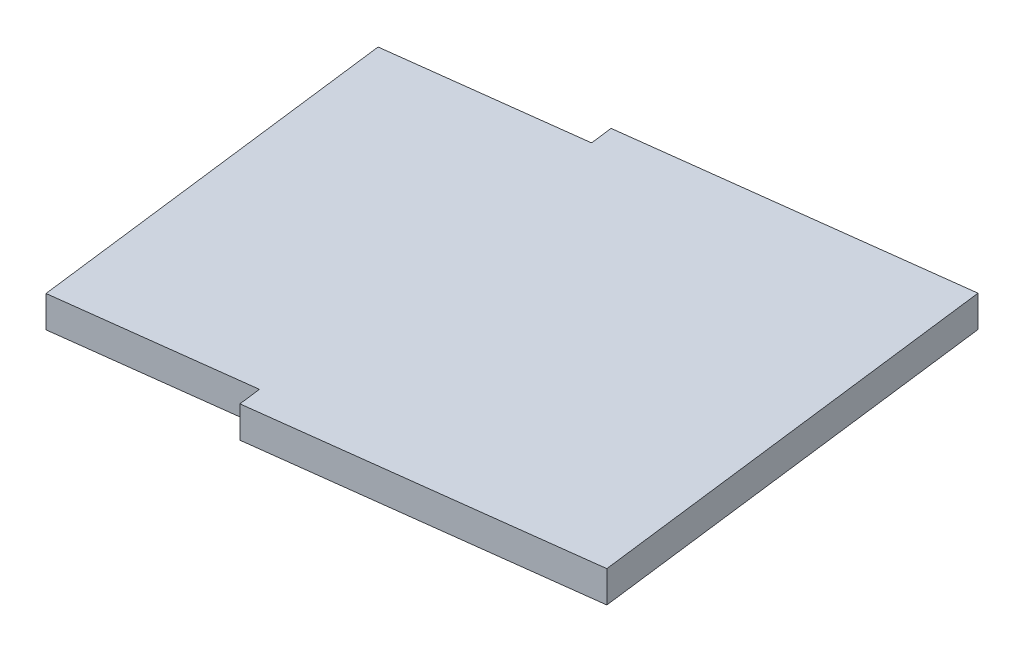
ISO-10303-21;
HEADER;
FILE_DESCRIPTION(('STEP AP214'),'2;1');
FILE_NAME('part.step','',(''),(''),'','','');
FILE_SCHEMA(('AUTOMOTIVE_DESIGN { 1 0 10303 214 1 1 1 1 }'));
ENDSEC;
DATA;
#1=APPLICATION_CONTEXT('core data for automotive mechanical design processes');
#2=APPLICATION_PROTOCOL_DEFINITION('international standard','automotive_design',2000,#1);
#3=PRODUCT_CONTEXT('',#1,'mechanical');
#4=PRODUCT('Part','Part','',(#3));
#5=PRODUCT_RELATED_PRODUCT_CATEGORY('part','',(#4));
#6=PRODUCT_DEFINITION_FORMATION('','',#4);
#7=PRODUCT_DEFINITION_CONTEXT('part definition',#1,'design');
#8=PRODUCT_DEFINITION('design','',#6,#7);
#9=PRODUCT_DEFINITION_SHAPE('','',#8);
#10=(LENGTH_UNIT() NAMED_UNIT(*) SI_UNIT(.MILLI.,.METRE.));
#11=(NAMED_UNIT(*) PLANE_ANGLE_UNIT() SI_UNIT($,.RADIAN.));
#12=(NAMED_UNIT(*) SI_UNIT($,.STERADIAN.) SOLID_ANGLE_UNIT());
#13=UNCERTAINTY_MEASURE_WITH_UNIT(LENGTH_MEASURE(1.E-05),#10,'distance_accuracy_value','');
#14=(GEOMETRIC_REPRESENTATION_CONTEXT(3) GLOBAL_UNCERTAINTY_ASSIGNED_CONTEXT((#13)) GLOBAL_UNIT_ASSIGNED_CONTEXT((#10,
#11,#12)) REPRESENTATION_CONTEXT('',''));
#15=CARTESIAN_POINT('',(0.,0.,0.));
#16=DIRECTION('',(0.,0.,1.));
#17=DIRECTION('',(1.,0.,0.));
#18=AXIS2_PLACEMENT_3D('',#15,#16,#17);
#19=CARTESIAN_POINT('',(112.403053245838,-13.5,-186.247955580301));
#20=DIRECTION('',(0.123954699359972,0.,0.992287877839178));
#21=DIRECTION('',(0.992287877839178,0.,-0.123954699359972));
#22=AXIS2_PLACEMENT_3D('',#19,#20,#21);
#23=PLANE('',#22);
#24=DIRECTION('',(0.,1.,0.));
#25=VECTOR('',#24,1.);
#26=CARTESIAN_POINT('',(112.403053245838,-13.5,-186.247955580301));
#27=LINE('',#26,#25);
#28=CARTESIAN_POINT('',(112.403053245838,-14.9,-186.247955580301));
#29=VERTEX_POINT('',#28);
#30=CARTESIAN_POINT('',(112.403053245838,-13.5,-186.247955580301));
#31=VERTEX_POINT('',#30);
#32=EDGE_CURVE('E148',#29,#31,#27,.T.);
#33=ORIENTED_EDGE('',*,*,#32,.T.);
#34=DIRECTION('',(0.992287877839178,0.,-0.123954699359972));
#35=VECTOR('',#34,1.);
#36=CARTESIAN_POINT('',(112.403053245838,-13.5,-186.247955580301));
#37=LINE('',#36,#35);
#38=CARTESIAN_POINT('',(126.901303790318,-13.5,-188.059049243361));
#39=VERTEX_POINT('',#38);
#40=EDGE_CURVE('E129',#31,#39,#37,.T.);
#41=ORIENTED_EDGE('',*,*,#40,.T.);
#42=DIRECTION('',(0.,1.,0.));
#43=VECTOR('',#42,1.);
#44=CARTESIAN_POINT('',(126.901303790318,-13.5,-188.059049243361));
#45=LINE('',#44,#43);
#46=CARTESIAN_POINT('',(126.901303790318,-14.9,-188.059049243361));
#47=VERTEX_POINT('',#46);
#48=EDGE_CURVE('E82',#47,#39,#45,.T.);
#49=ORIENTED_EDGE('',*,*,#48,.F.);
#50=DIRECTION('',(0.992287877839178,0.,-0.123954699359972));
#51=VECTOR('',#50,1.);
#52=CARTESIAN_POINT('',(112.403053245838,-14.9,-186.247955580301));
#53=LINE('',#52,#51);
#54=EDGE_CURVE('E201',#29,#47,#53,.T.);
#55=ORIENTED_EDGE('',*,*,#54,.F.);
#56=EDGE_LOOP('',(#33,#41,#49,#55));
#57=FACE_BOUND('',#56,.T.);
#58=ADVANCED_FACE('F58',(#57),#23,.F.);
#59=CARTESIAN_POINT('',(114.758192533677,-13.5,-167.394485901356));
#60=DIRECTION('',(-0.123954699359963,0.,-0.992287877839179));
#61=DIRECTION('',(-0.992287877839179,0.,0.123954699359963));
#62=AXIS2_PLACEMENT_3D('',#59,#60,#61);
#63=PLANE('',#62);
#64=DIRECTION('',(0.,1.,0.));
#65=VECTOR('',#64,1.);
#66=CARTESIAN_POINT('',(129.256443078158,-13.5,-169.205579564417));
#67=LINE('',#66,#65);
#68=CARTESIAN_POINT('',(129.256443078158,-14.9,-169.205579564417));
#69=VERTEX_POINT('',#68);
#70=CARTESIAN_POINT('',(129.256443078158,-13.5,-169.205579564417));
#71=VERTEX_POINT('',#70);
#72=EDGE_CURVE('E74',#69,#71,#67,.T.);
#73=ORIENTED_EDGE('',*,*,#72,.T.);
#74=DIRECTION('',(-0.992287877839179,0.,0.123954699359963));
#75=VECTOR('',#74,1.);
#76=CARTESIAN_POINT('',(114.758192533677,-13.5,-167.394485901356));
#77=LINE('',#76,#75);
#78=CARTESIAN_POINT('',(114.758192533677,-13.5,-167.394485901356));
#79=VERTEX_POINT('',#78);
#80=EDGE_CURVE('E132',#71,#79,#77,.T.);
#81=ORIENTED_EDGE('',*,*,#80,.T.);
#82=DIRECTION('',(0.,1.,0.));
#83=VECTOR('',#82,1.);
#84=CARTESIAN_POINT('',(114.758192533677,-13.5,-167.394485901356));
#85=LINE('',#84,#83);
#86=CARTESIAN_POINT('',(114.758192533677,-14.9,-167.394485901356));
#87=VERTEX_POINT('',#86);
#88=EDGE_CURVE('E144',#87,#79,#85,.T.);
#89=ORIENTED_EDGE('',*,*,#88,.F.);
#90=DIRECTION('',(-0.992287877839179,0.,0.123954699359963));
#91=VECTOR('',#90,1.);
#92=CARTESIAN_POINT('',(129.256443078158,-14.9,-169.205579564417));
#93=LINE('',#92,#91);
#94=EDGE_CURVE('E128',#69,#87,#93,.T.);
#95=ORIENTED_EDGE('',*,*,#94,.F.);
#96=EDGE_LOOP('',(#73,#81,#89,#95));
#97=FACE_BOUND('',#96,.T.);
#98=ADVANCED_FACE('F141',(#97),#63,.F.);
#99=CARTESIAN_POINT('',(148.082521914135,0.5,-18.4981847448383));
#100=DIRECTION('',(-0.992287877839178,0.,0.123954699359969));
#101=DIRECTION('',(0.123954699359969,0.,0.992287877839178));
#102=AXIS2_PLACEMENT_3D('',#99,#100,#101);
#103=PLANE('',#102);
#104=ORIENTED_EDGE('',*,*,#48,.T.);
#105=DIRECTION('',(0.123954699359967,0.,0.992287877839178));
#106=VECTOR('',#105,1.);
#107=CARTESIAN_POINT('',(129.256443078158,-13.5,-169.205579564417));
#108=LINE('',#107,#106);
#109=EDGE_CURVE('E124',#39,#71,#108,.T.);
#110=ORIENTED_EDGE('',*,*,#109,.T.);
#111=ORIENTED_EDGE('',*,*,#72,.F.);
#112=DIRECTION('',(0.123954699359967,0.,0.992287877839178));
#113=VECTOR('',#112,1.);
#114=CARTESIAN_POINT('',(129.256443078158,-14.9,-169.205579564417));
#115=LINE('',#114,#113);
#116=EDGE_CURVE('E150',#47,#69,#115,.T.);
#117=ORIENTED_EDGE('',*,*,#116,.F.);
#118=EDGE_LOOP('',(#104,#110,#111,#117));
#119=FACE_BOUND('',#118,.T.);
#120=ADVANCED_FACE('F60',(#119),#103,.F.);
#121=CARTESIAN_POINT('',(118.538810864156,-2.,-137.129705627261));
#122=DIRECTION('',(0.992287877839178,0.,-0.12395469935997));
#123=DIRECTION('',(-0.12395469935997,0.,-0.992287877839178));
#124=AXIS2_PLACEMENT_3D('',#121,#122,#123);
#125=PLANE('',#124);
#126=ORIENTED_EDGE('',*,*,#88,.T.);
#127=DIRECTION('',(-0.12395469935997,0.,-0.992287877839178));
#128=VECTOR('',#127,1.);
#129=CARTESIAN_POINT('',(118.538810864156,-13.5,-137.129705627261));
#130=LINE('',#129,#128);
#131=CARTESIAN_POINT('',(114.634237834317,-13.5,-168.386773779195));
#132=VERTEX_POINT('',#131);
#133=EDGE_CURVE('E135',#79,#132,#130,.T.);
#134=ORIENTED_EDGE('',*,*,#133,.T.);
#135=DIRECTION('',(0.,1.,0.));
#136=VECTOR('',#135,1.);
#137=CARTESIAN_POINT('',(114.634237834317,-2.,-168.386773779195));
#138=LINE('',#137,#136);
#139=CARTESIAN_POINT('',(114.634237834317,-14.9,-168.386773779195));
#140=VERTEX_POINT('',#139);
#141=EDGE_CURVE('E12',#140,#132,#138,.T.);
#142=ORIENTED_EDGE('',*,*,#141,.F.);
#143=DIRECTION('',(-0.123954699359952,0.,-0.99228787783918));
#144=VECTOR('',#143,1.);
#145=CARTESIAN_POINT('',(114.758192533677,-14.9,-167.394485901356));
#146=LINE('',#145,#144);
#147=EDGE_CURVE('E185',#87,#140,#146,.T.);
#148=ORIENTED_EDGE('',*,*,#147,.F.);
#149=EDGE_LOOP('',(#126,#134,#142,#148));
#150=FACE_BOUND('',#149,.T.);
#151=ADVANCED_FACE('F226',(#150),#125,.F.);
#152=CARTESIAN_POINT('',(106.199790872684,-2.,-167.333158834636));
#153=DIRECTION('',(-0.123954699359963,0.,-0.992287877839179));
#154=DIRECTION('',(-0.992287877839179,0.,0.123954699359963));
#155=AXIS2_PLACEMENT_3D('',#152,#153,#154);
#156=PLANE('',#155);
#157=ORIENTED_EDGE('',*,*,#141,.T.);
#158=DIRECTION('',(-0.992287877839179,0.,0.123954699359963));
#159=VECTOR('',#158,1.);
#160=CARTESIAN_POINT('',(106.199790872684,-13.5,-167.333158834636));
#161=LINE('',#160,#159);
#162=CARTESIAN_POINT('',(106.199790872684,-13.5,-167.333158834636));
#163=VERTEX_POINT('',#162);
#164=EDGE_CURVE('E178',#132,#163,#161,.T.);
#165=ORIENTED_EDGE('',*,*,#164,.T.);
#166=DIRECTION('',(0.,1.,0.));
#167=VECTOR('',#166,1.);
#168=CARTESIAN_POINT('',(106.199790872684,-2.,-167.333158834636));
#169=LINE('',#168,#167);
#170=CARTESIAN_POINT('',(106.199790872684,-14.9,-167.333158834636));
#171=VERTEX_POINT('',#170);
#172=EDGE_CURVE('E67',#171,#163,#169,.T.);
#173=ORIENTED_EDGE('',*,*,#172,.F.);
#174=DIRECTION('',(-0.992287877839179,0.,0.123954699359963));
#175=VECTOR('',#174,1.);
#176=CARTESIAN_POINT('',(114.634237834317,-14.9,-168.386773779195));
#177=LINE('',#176,#175);
#178=EDGE_CURVE('E177',#140,#171,#177,.T.);
#179=ORIENTED_EDGE('',*,*,#178,.F.);
#180=EDGE_LOOP('',(#157,#165,#173,#179));
#181=FACE_BOUND('',#180,.T.);
#182=ADVANCED_FACE('F176',(#181),#156,.F.);
#183=CARTESIAN_POINT('',(104.092560983565,-2.,-184.202052757902));
#184=DIRECTION('',(0.992287877839178,0.,-0.123954699359969));
#185=DIRECTION('',(-0.123954699359969,0.,-0.992287877839178));
#186=AXIS2_PLACEMENT_3D('',#183,#184,#185);
#187=PLANE('',#186);
#188=ORIENTED_EDGE('',*,*,#172,.T.);
#189=DIRECTION('',(-0.123954699359969,0.,-0.992287877839178));
#190=VECTOR('',#189,1.);
#191=CARTESIAN_POINT('',(104.092560983565,-13.5,-184.202052757902));
#192=LINE('',#191,#190);
#193=CARTESIAN_POINT('',(104.092560983565,-13.5,-184.202052757902));
#194=VERTEX_POINT('',#193);
#195=EDGE_CURVE('E169',#163,#194,#192,.T.);
#196=ORIENTED_EDGE('',*,*,#195,.T.);
#197=DIRECTION('',(0.,1.,0.));
#198=VECTOR('',#197,1.);
#199=CARTESIAN_POINT('',(104.092560983565,-2.,-184.202052757902));
#200=LINE('',#199,#198);
#201=CARTESIAN_POINT('',(104.092560983565,-14.9,-184.202052757902));
#202=VERTEX_POINT('',#201);
#203=EDGE_CURVE('E160',#202,#194,#200,.T.);
#204=ORIENTED_EDGE('',*,*,#203,.F.);
#205=DIRECTION('',(-0.123954699359969,0.,-0.992287877839178));
#206=VECTOR('',#205,1.);
#207=CARTESIAN_POINT('',(106.199790872684,-14.9,-167.333158834636));
#208=LINE('',#207,#206);
#209=EDGE_CURVE('E171',#171,#202,#208,.T.);
#210=ORIENTED_EDGE('',*,*,#209,.F.);
#211=EDGE_LOOP('',(#188,#196,#204,#210));
#212=FACE_BOUND('',#211,.T.);
#213=ADVANCED_FACE('F168',(#212),#187,.F.);
#214=CARTESIAN_POINT('',(112.527007945198,-2.,-185.255667702461));
#215=DIRECTION('',(0.123954699359966,0.,0.992287877839178));
#216=DIRECTION('',(0.992287877839179,0.,-0.123954699359966));
#217=AXIS2_PLACEMENT_3D('',#214,#215,#216);
#218=PLANE('',#217);
#219=ORIENTED_EDGE('',*,*,#203,.T.);
#220=DIRECTION('',(0.992287877839179,0.,-0.123954699359966));
#221=VECTOR('',#220,1.);
#222=CARTESIAN_POINT('',(112.527007945198,-13.5,-185.255667702461));
#223=LINE('',#222,#221);
#224=CARTESIAN_POINT('',(112.527007945198,-13.5,-185.255667702461));
#225=VERTEX_POINT('',#224);
#226=EDGE_CURVE('E212',#194,#225,#223,.T.);
#227=ORIENTED_EDGE('',*,*,#226,.T.);
#228=DIRECTION('',(0.,1.,0.));
#229=VECTOR('',#228,1.);
#230=CARTESIAN_POINT('',(112.527007945198,-2.,-185.255667702461));
#231=LINE('',#230,#229);
#232=CARTESIAN_POINT('',(112.527007945198,-14.9,-185.255667702461));
#233=VERTEX_POINT('',#232);
#234=EDGE_CURVE('E156',#233,#225,#231,.T.);
#235=ORIENTED_EDGE('',*,*,#234,.F.);
#236=DIRECTION('',(0.992287877839179,0.,-0.123954699359966));
#237=VECTOR('',#236,1.);
#238=CARTESIAN_POINT('',(104.092560983565,-14.9,-184.202052757902));
#239=LINE('',#238,#237);
#240=EDGE_CURVE('E190',#202,#233,#239,.T.);
#241=ORIENTED_EDGE('',*,*,#240,.F.);
#242=EDGE_LOOP('',(#219,#227,#235,#241));
#243=FACE_BOUND('',#242,.T.);
#244=ADVANCED_FACE('F244',(#243),#218,.F.);
#245=CARTESIAN_POINT('',(112.527007945198,-2.,-185.255667702461));
#246=DIRECTION('',(0.992287877839178,0.,-0.123954699359969));
#247=DIRECTION('',(-0.123954699359969,0.,-0.992287877839178));
#248=AXIS2_PLACEMENT_3D('',#245,#246,#247);
#249=PLANE('',#248);
#250=ORIENTED_EDGE('',*,*,#234,.T.);
#251=DIRECTION('',(-0.123954699359969,0.,-0.992287877839178));
#252=VECTOR('',#251,1.);
#253=CARTESIAN_POINT('',(112.527007945198,-13.5,-185.255667702461));
#254=LINE('',#253,#252);
#255=EDGE_CURVE('E209',#225,#31,#254,.T.);
#256=ORIENTED_EDGE('',*,*,#255,.T.);
#257=ORIENTED_EDGE('',*,*,#32,.F.);
#258=DIRECTION('',(-0.123954699359959,0.,-0.992287877839179));
#259=VECTOR('',#258,1.);
#260=CARTESIAN_POINT('',(112.527007945198,-14.9,-185.255667702461));
#261=LINE('',#260,#259);
#262=EDGE_CURVE('E197',#233,#29,#261,.T.);
#263=ORIENTED_EDGE('',*,*,#262,.F.);
#264=EDGE_LOOP('',(#250,#256,#257,#263));
#265=FACE_BOUND('',#264,.T.);
#266=ADVANCED_FACE('F208',(#265),#249,.F.);
#267=CARTESIAN_POINT('',(0.,-13.5,0.));
#268=DIRECTION('',(0.,-1.,0.));
#269=DIRECTION('',(0.,0.,-1.));
#270=AXIS2_PLACEMENT_3D('',#267,#268,#269);
#271=PLANE('',#270);
#272=ORIENTED_EDGE('',*,*,#109,.F.);
#273=ORIENTED_EDGE('',*,*,#40,.F.);
#274=ORIENTED_EDGE('',*,*,#255,.F.);
#275=ORIENTED_EDGE('',*,*,#226,.F.);
#276=ORIENTED_EDGE('',*,*,#195,.F.);
#277=ORIENTED_EDGE('',*,*,#164,.F.);
#278=ORIENTED_EDGE('',*,*,#133,.F.);
#279=ORIENTED_EDGE('',*,*,#80,.F.);
#280=EDGE_LOOP('',(#272,#273,#274,#275,#276,#277,#278,#279));
#281=FACE_BOUND('',#280,.T.);
#282=ADVANCED_FACE('F133',(#281),#271,.F.);
#283=CARTESIAN_POINT('',(0.,-14.9,0.));
#284=DIRECTION('',(0.,-1.,0.));
#285=DIRECTION('',(0.,0.,-1.));
#286=AXIS2_PLACEMENT_3D('',#283,#284,#285);
#287=PLANE('',#286);
#288=ORIENTED_EDGE('',*,*,#94,.T.);
#289=ORIENTED_EDGE('',*,*,#147,.T.);
#290=ORIENTED_EDGE('',*,*,#178,.T.);
#291=ORIENTED_EDGE('',*,*,#209,.T.);
#292=ORIENTED_EDGE('',*,*,#240,.T.);
#293=ORIENTED_EDGE('',*,*,#262,.T.);
#294=ORIENTED_EDGE('',*,*,#54,.T.);
#295=ORIENTED_EDGE('',*,*,#116,.T.);
#296=EDGE_LOOP('',(#288,#289,#290,#291,#292,#293,#294,#295));
#297=FACE_BOUND('',#296,.T.);
#298=ADVANCED_FACE('F181',(#297),#287,.T.);
#299=CLOSED_SHELL('',(#58,#98,#120,#151,#182,#213,#244,#266,#282,#298));
#300=MANIFOLD_SOLID_BREP('B2',#299);
#301=ADVANCED_BREP_SHAPE_REPRESENTATION('',(#18,#300),#14);
#302=SHAPE_DEFINITION_REPRESENTATION(#9,#301);
ENDSEC;
END-ISO-10303-21;
